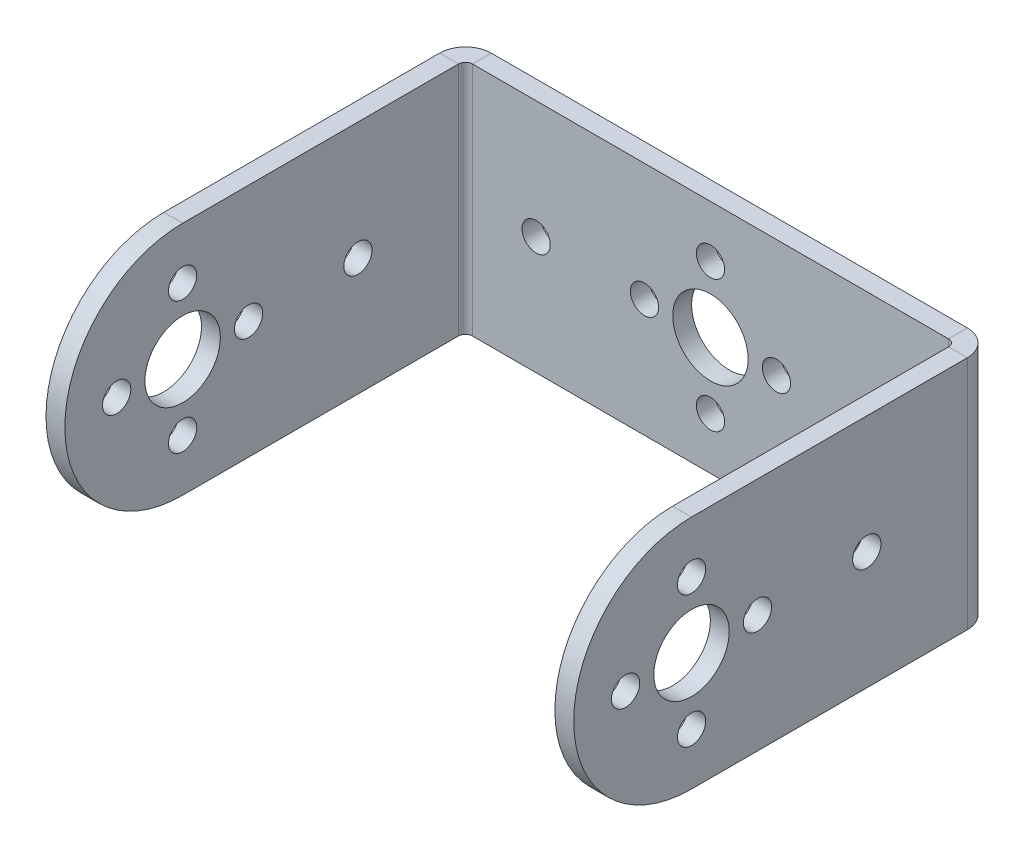
ISO-10303-21;
HEADER;
FILE_DESCRIPTION(('STEP AP214'),'2;1');
FILE_NAME('part.step','',(''),(''),'','','');
FILE_SCHEMA(('AUTOMOTIVE_DESIGN { 1 0 10303 214 1 1 1 1 }'));
ENDSEC;
DATA;
#1=APPLICATION_CONTEXT('core data for automotive mechanical design processes');
#2=APPLICATION_PROTOCOL_DEFINITION('international standard','automotive_design',2000,#1);
#3=PRODUCT_CONTEXT('',#1,'mechanical');
#4=PRODUCT('Part','Part','',(#3));
#5=PRODUCT_RELATED_PRODUCT_CATEGORY('part','',(#4));
#6=PRODUCT_DEFINITION_FORMATION('','',#4);
#7=PRODUCT_DEFINITION_CONTEXT('part definition',#1,'design');
#8=PRODUCT_DEFINITION('design','',#6,#7);
#9=PRODUCT_DEFINITION_SHAPE('','',#8);
#10=(LENGTH_UNIT() NAMED_UNIT(*) SI_UNIT(.MILLI.,.METRE.));
#11=(NAMED_UNIT(*) PLANE_ANGLE_UNIT() SI_UNIT($,.RADIAN.));
#12=(NAMED_UNIT(*) SI_UNIT($,.STERADIAN.) SOLID_ANGLE_UNIT());
#13=UNCERTAINTY_MEASURE_WITH_UNIT(LENGTH_MEASURE(1.E-05),#10,'distance_accuracy_value','');
#14=(GEOMETRIC_REPRESENTATION_CONTEXT(3) GLOBAL_UNCERTAINTY_ASSIGNED_CONTEXT((#13)) GLOBAL_UNIT_ASSIGNED_CONTEXT((#10,
#11,#12)) REPRESENTATION_CONTEXT('',''));
#15=CARTESIAN_POINT('',(0.,0.,0.));
#16=DIRECTION('',(0.,0.,1.));
#17=DIRECTION('',(1.,0.,0.));
#18=AXIS2_PLACEMENT_3D('',#15,#16,#17);
#19=CARTESIAN_POINT('',(-0.999999999999997,-25.,0.));
#20=DIRECTION('',(0.,-1.,0.));
#21=DIRECTION('',(1.,0.,0.));
#22=AXIS2_PLACEMENT_3D('',#19,#20,#21);
#23=PLANE('',#22);
#24=DIRECTION('',(0.,0.,1.));
#25=VECTOR('',#24,1.);
#26=CARTESIAN_POINT('',(1.,-25.,0.));
#27=LINE('',#26,#25);
#28=CARTESIAN_POINT('',(0.999999999999898,-25.,30.0096705338575));
#29=VERTEX_POINT('',#28);
#30=CARTESIAN_POINT('',(1.,-25.,0.736599999999999));
#31=VERTEX_POINT('',#30);
#32=EDGE_CURVE('E196',#29,#31,#27,.F.);
#33=ORIENTED_EDGE('',*,*,#32,.F.);
#34=DIRECTION('',(1.,0.,0.));
#35=VECTOR('',#34,1.);
#36=CARTESIAN_POINT('',(0.999999999999898,-25.,30.0096705338573));
#37=LINE('',#36,#35);
#38=CARTESIAN_POINT('',(-1.0000000000001,-25.,30.0096705338573));
#39=VERTEX_POINT('',#38);
#40=EDGE_CURVE('E100',#29,#39,#37,.F.);
#41=ORIENTED_EDGE('',*,*,#40,.T.);
#42=DIRECTION('',(0.,0.,-1.));
#43=VECTOR('',#42,1.);
#44=CARTESIAN_POINT('',(-0.999999999999997,-25.,0.));
#45=LINE('',#44,#43);
#46=CARTESIAN_POINT('',(-1.,-25.,0.736599999999991));
#47=VERTEX_POINT('',#46);
#48=EDGE_CURVE('E189',#39,#47,#45,.T.);
#49=ORIENTED_EDGE('',*,*,#48,.T.);
#50=DIRECTION('',(-1.,0.,0.));
#51=VECTOR('',#50,1.);
#52=CARTESIAN_POINT('',(1.,-25.,0.736599999999998));
#53=LINE('',#52,#51);
#54=EDGE_CURVE('E213',#31,#47,#53,.T.);
#55=ORIENTED_EDGE('',*,*,#54,.F.);
#56=EDGE_LOOP('',(#33,#41,#49,#55));
#57=FACE_BOUND('',#56,.T.);
#58=ADVANCED_FACE('F82',(#57),#23,.T.);
#59=CARTESIAN_POINT('',(-1.,0.,0.));
#60=DIRECTION('',(-1.,0.,0.));
#61=DIRECTION('',(0.,0.,1.));
#62=AXIS2_PLACEMENT_3D('',#59,#60,#61);
#63=PLANE('',#62);
#64=CARTESIAN_POINT('',(-1.00000000000021,-12.5,11.4096705338575));
#65=DIRECTION('',(1.,0.,0.));
#66=DIRECTION('',(0.,0.,-1.));
#67=AXIS2_PLACEMENT_3D('',#64,#65,#66);
#68=CIRCLE('',#67,1.5);
#69=CARTESIAN_POINT('',(-1.00000000000021,-12.5,9.90967053385751));
#70=VERTEX_POINT('',#69);
#71=EDGE_CURVE('E1079',#70,#70,#68,.T.);
#72=ORIENTED_EDGE('',*,*,#71,.T.);
#73=EDGE_LOOP('',(#72));
#74=FACE_BOUND('',#73,.T.);
#75=CARTESIAN_POINT('',(-1.00000000000017,-12.5,23.0096705338575));
#76=DIRECTION('',(1.,0.,0.));
#77=DIRECTION('',(0.,0.,-1.));
#78=AXIS2_PLACEMENT_3D('',#75,#76,#77);
#79=CIRCLE('',#78,1.5);
#80=CARTESIAN_POINT('',(-1.00000000000018,-12.5,21.5096705338575));
#81=VERTEX_POINT('',#80);
#82=EDGE_CURVE('E347',#81,#81,#79,.T.);
#83=ORIENTED_EDGE('',*,*,#82,.T.);
#84=EDGE_LOOP('',(#83));
#85=FACE_BOUND('',#84,.T.);
#86=CARTESIAN_POINT('',(-1.00000000000015,-5.5,30.0096705338575));
#87=DIRECTION('',(1.,0.,0.));
#88=DIRECTION('',(0.,0.,-1.));
#89=AXIS2_PLACEMENT_3D('',#86,#87,#88);
#90=CIRCLE('',#89,1.5);
#91=CARTESIAN_POINT('',(-1.00000000000015,-5.5,28.5096705338575));
#92=VERTEX_POINT('',#91);
#93=EDGE_CURVE('E342',#92,#92,#90,.T.);
#94=ORIENTED_EDGE('',*,*,#93,.T.);
#95=EDGE_LOOP('',(#94));
#96=FACE_BOUND('',#95,.T.);
#97=CARTESIAN_POINT('',(-1.00000000000013,-12.5,37.0096705338575));
#98=DIRECTION('',(1.,0.,0.));
#99=DIRECTION('',(0.,0.,-1.));
#100=AXIS2_PLACEMENT_3D('',#97,#98,#99);
#101=CIRCLE('',#100,1.5);
#102=CARTESIAN_POINT('',(-1.00000000000013,-12.5,35.5096705338575));
#103=VERTEX_POINT('',#102);
#104=EDGE_CURVE('E337',#103,#103,#101,.T.);
#105=ORIENTED_EDGE('',*,*,#104,.T.);
#106=EDGE_LOOP('',(#105));
#107=FACE_BOUND('',#106,.T.);
#108=CARTESIAN_POINT('',(-1.00000000000015,-19.5,30.0096705338575));
#109=DIRECTION('',(1.,0.,0.));
#110=DIRECTION('',(0.,0.,-1.));
#111=AXIS2_PLACEMENT_3D('',#108,#109,#110);
#112=CIRCLE('',#111,1.5);
#113=CARTESIAN_POINT('',(-1.00000000000015,-19.5,28.5096705338575));
#114=VERTEX_POINT('',#113);
#115=EDGE_CURVE('E331',#114,#114,#112,.T.);
#116=ORIENTED_EDGE('',*,*,#115,.T.);
#117=EDGE_LOOP('',(#116));
#118=FACE_BOUND('',#117,.T.);
#119=CARTESIAN_POINT('',(-1.00000000000015,-12.5,30.0096705338575));
#120=DIRECTION('',(1.,0.,0.));
#121=DIRECTION('',(0.,0.,-1.));
#122=AXIS2_PLACEMENT_3D('',#119,#120,#121);
#123=CIRCLE('',#122,4.);
#124=CARTESIAN_POINT('',(-1.00000000000016,-12.5,26.0096705338575));
#125=VERTEX_POINT('',#124);
#126=EDGE_CURVE('E325',#125,#125,#123,.T.);
#127=ORIENTED_EDGE('',*,*,#126,.T.);
#128=EDGE_LOOP('',(#127));
#129=FACE_BOUND('',#128,.T.);
#130=ORIENTED_EDGE('',*,*,#48,.F.);
#131=CARTESIAN_POINT('',(-1.0000000000001,-12.5,30.0096705338575));
#132=DIRECTION('',(-1.,0.,0.));
#133=DIRECTION('',(0.,0.,1.));
#134=AXIS2_PLACEMENT_3D('',#131,#132,#133);
#135=CIRCLE('',#134,12.5);
#136=CARTESIAN_POINT('',(-1.0000000000001,0.,30.0096705338575));
#137=VERTEX_POINT('',#136);
#138=EDGE_CURVE('E174',#39,#137,#135,.T.);
#139=ORIENTED_EDGE('',*,*,#138,.T.);
#140=DIRECTION('',(0.,0.,1.));
#141=VECTOR('',#140,1.);
#142=CARTESIAN_POINT('',(-1.00000000000016,0.,44.5));
#143=LINE('',#142,#141);
#144=CARTESIAN_POINT('',(-1.,0.,0.73659999999999));
#145=VERTEX_POINT('',#144);
#146=EDGE_CURVE('E188',#145,#137,#143,.T.);
#147=ORIENTED_EDGE('',*,*,#146,.F.);
#148=DIRECTION('',(0.,-1.,0.));
#149=VECTOR('',#148,1.);
#150=CARTESIAN_POINT('',(-1.,0.,0.73659999999999));
#151=LINE('',#150,#149);
#152=EDGE_CURVE('E210',#145,#47,#151,.T.);
#153=ORIENTED_EDGE('',*,*,#152,.T.);
#154=EDGE_LOOP('',(#130,#139,#147,#153));
#155=FACE_BOUND('',#154,.T.);
#156=ADVANCED_FACE('F186',(#74,#85,#96,#107,#118,#129,#155),#63,.T.);
#157=CARTESIAN_POINT('',(1.,0.,0.));
#158=DIRECTION('',(-1.,0.,0.));
#159=DIRECTION('',(0.,0.,1.));
#160=AXIS2_PLACEMENT_3D('',#157,#158,#159);
#161=PLANE('',#160);
#162=CARTESIAN_POINT('',(0.999999999999962,-12.5,11.4096705338575));
#163=DIRECTION('',(-1.,0.,0.));
#164=DIRECTION('',(0.,0.,1.));
#165=AXIS2_PLACEMENT_3D('',#162,#163,#164);
#166=CIRCLE('',#165,1.5);
#167=CARTESIAN_POINT('',(0.999999999999957,-12.5,12.9096705338575));
#168=VERTEX_POINT('',#167);
#169=EDGE_CURVE('E364',#168,#168,#166,.T.);
#170=ORIENTED_EDGE('',*,*,#169,.T.);
#171=EDGE_LOOP('',(#170));
#172=FACE_BOUND('',#171,.T.);
#173=CARTESIAN_POINT('',(0.999999999999922,-12.5,23.0096705338575));
#174=DIRECTION('',(-1.,0.,0.));
#175=DIRECTION('',(0.,0.,1.));
#176=AXIS2_PLACEMENT_3D('',#173,#174,#175);
#177=CIRCLE('',#176,1.5);
#178=CARTESIAN_POINT('',(0.999999999999916,-12.5,24.5096705338575));
#179=VERTEX_POINT('',#178);
#180=EDGE_CURVE('E346',#179,#179,#177,.T.);
#181=ORIENTED_EDGE('',*,*,#180,.T.);
#182=EDGE_LOOP('',(#181));
#183=FACE_BOUND('',#182,.T.);
#184=CARTESIAN_POINT('',(0.999999999999896,-5.5,30.0096705338575));
#185=DIRECTION('',(-1.,0.,0.));
#186=DIRECTION('',(0.,0.,1.));
#187=AXIS2_PLACEMENT_3D('',#184,#185,#186);
#188=CIRCLE('',#187,1.5);
#189=CARTESIAN_POINT('',(0.999999999999891,-5.5,31.5096705338575));
#190=VERTEX_POINT('',#189);
#191=EDGE_CURVE('E341',#190,#190,#188,.T.);
#192=ORIENTED_EDGE('',*,*,#191,.T.);
#193=EDGE_LOOP('',(#192));
#194=FACE_BOUND('',#193,.T.);
#195=CARTESIAN_POINT('',(0.999999999999873,-12.5,37.0096705338575));
#196=DIRECTION('',(-1.,0.,0.));
#197=DIRECTION('',(0.,0.,1.));
#198=AXIS2_PLACEMENT_3D('',#195,#196,#197);
#199=CIRCLE('',#198,1.5);
#200=CARTESIAN_POINT('',(0.999999999999867,-12.5,38.5096705338575));
#201=VERTEX_POINT('',#200);
#202=EDGE_CURVE('E336',#201,#201,#199,.T.);
#203=ORIENTED_EDGE('',*,*,#202,.T.);
#204=EDGE_LOOP('',(#203));
#205=FACE_BOUND('',#204,.T.);
#206=CARTESIAN_POINT('',(0.999999999999898,-19.5,30.0096705338575));
#207=DIRECTION('',(-1.,0.,0.));
#208=DIRECTION('',(0.,0.,1.));
#209=AXIS2_PLACEMENT_3D('',#206,#207,#208);
#210=CIRCLE('',#209,1.5);
#211=CARTESIAN_POINT('',(0.999999999999892,-19.5,31.5096705338575));
#212=VERTEX_POINT('',#211);
#213=EDGE_CURVE('E330',#212,#212,#210,.T.);
#214=ORIENTED_EDGE('',*,*,#213,.T.);
#215=EDGE_LOOP('',(#214));
#216=FACE_BOUND('',#215,.T.);
#217=CARTESIAN_POINT('',(0.999999999999897,-12.5,30.0096705338575));
#218=DIRECTION('',(-1.,0.,0.));
#219=DIRECTION('',(0.,0.,1.));
#220=AXIS2_PLACEMENT_3D('',#217,#218,#219);
#221=CIRCLE('',#220,4.);
#222=CARTESIAN_POINT('',(0.999999999999883,-12.5,34.0096705338575));
#223=VERTEX_POINT('',#222);
#224=EDGE_CURVE('E324',#223,#223,#221,.T.);
#225=ORIENTED_EDGE('',*,*,#224,.T.);
#226=EDGE_LOOP('',(#225));
#227=FACE_BOUND('',#226,.T.);
#228=CARTESIAN_POINT('',(0.999999999999897,-12.5,30.0096705338575));
#229=DIRECTION('',(-1.,0.,0.));
#230=DIRECTION('',(0.,0.,1.));
#231=AXIS2_PLACEMENT_3D('',#228,#229,#230);
#232=CIRCLE('',#231,12.5);
#233=CARTESIAN_POINT('',(0.999999999999895,0.,30.0096705338575));
#234=VERTEX_POINT('',#233);
#235=EDGE_CURVE('E175',#29,#234,#232,.T.);
#236=ORIENTED_EDGE('',*,*,#235,.F.);
#237=ORIENTED_EDGE('',*,*,#32,.T.);
#238=DIRECTION('',(0.,1.,0.));
#239=VECTOR('',#238,1.);
#240=CARTESIAN_POINT('',(0.999999999999997,0.,0.736599999999997));
#241=LINE('',#240,#239);
#242=CARTESIAN_POINT('',(0.999999999999997,0.,0.736599999999997));
#243=VERTEX_POINT('',#242);
#244=EDGE_CURVE('E217',#243,#31,#241,.F.);
#245=ORIENTED_EDGE('',*,*,#244,.F.);
#246=DIRECTION('',(0.,0.,-1.));
#247=VECTOR('',#246,1.);
#248=CARTESIAN_POINT('',(1.,0.,0.));
#249=LINE('',#248,#247);
#250=EDGE_CURVE('E204',#243,#234,#249,.F.);
#251=ORIENTED_EDGE('',*,*,#250,.T.);
#252=EDGE_LOOP('',(#236,#237,#245,#251));
#253=FACE_BOUND('',#252,.T.);
#254=ADVANCED_FACE('F529',(#172,#183,#194,#205,#216,#227,#253),#161,.F.);
#255=CARTESIAN_POINT('',(55.,-25.,0.));
#256=DIRECTION('',(0.,-1.,0.));
#257=DIRECTION('',(0.,0.,-1.));
#258=AXIS2_PLACEMENT_3D('',#255,#256,#257);
#259=PLANE('',#258);
#260=DIRECTION('',(0.,0.,-1.));
#261=VECTOR('',#260,1.);
#262=CARTESIAN_POINT('',(55.,-25.,0.));
#263=LINE('',#262,#261);
#264=CARTESIAN_POINT('',(55.,-25.,0.73659999999999));
#265=VERTEX_POINT('',#264);
#266=CARTESIAN_POINT('',(55.0000000000001,-25.,30.0096705338573));
#267=VERTEX_POINT('',#266);
#268=EDGE_CURVE('E427',#265,#267,#263,.F.);
#269=ORIENTED_EDGE('',*,*,#268,.T.);
#270=DIRECTION('',(-1.,0.,0.));
#271=VECTOR('',#270,1.);
#272=CARTESIAN_POINT('',(53.0000000000001,-25.,30.0096705338573));
#273=LINE('',#272,#271);
#274=CARTESIAN_POINT('',(53.0000000000001,-25.,30.0096705338573));
#275=VERTEX_POINT('',#274);
#276=EDGE_CURVE('E415',#275,#267,#273,.F.);
#277=ORIENTED_EDGE('',*,*,#276,.F.);
#278=DIRECTION('',(0.,0.,1.));
#279=VECTOR('',#278,1.);
#280=CARTESIAN_POINT('',(53.,-25.,-1.8524507770431E-13));
#281=LINE('',#280,#279);
#282=CARTESIAN_POINT('',(53.,-25.,0.736599999999997));
#283=VERTEX_POINT('',#282);
#284=EDGE_CURVE('E434',#283,#275,#281,.T.);
#285=ORIENTED_EDGE('',*,*,#284,.F.);
#286=DIRECTION('',(1.,0.,0.));
#287=VECTOR('',#286,1.);
#288=CARTESIAN_POINT('',(55.,-25.,0.73659999999999));
#289=LINE('',#288,#287);
#290=EDGE_CURVE('E420',#283,#265,#289,.T.);
#291=ORIENTED_EDGE('',*,*,#290,.T.);
#292=EDGE_LOOP('',(#269,#277,#285,#291));
#293=FACE_BOUND('',#292,.T.);
#294=ADVANCED_FACE('F506',(#293),#259,.T.);
#295=CARTESIAN_POINT('',(55.,0.,-1.92228040381996E-13));
#296=DIRECTION('',(-1.,0.,0.));
#297=DIRECTION('',(0.,0.,1.));
#298=AXIS2_PLACEMENT_3D('',#295,#296,#297);
#299=PLANE('',#298);
#300=CARTESIAN_POINT('',(55.,-12.5,11.4096705338573));
#301=DIRECTION('',(1.,0.,0.));
#302=DIRECTION('',(0.,0.,-1.));
#303=AXIS2_PLACEMENT_3D('',#300,#301,#302);
#304=CIRCLE('',#303,1.5);
#305=CARTESIAN_POINT('',(55.,-12.5,9.90967053385731));
#306=VERTEX_POINT('',#305);
#307=EDGE_CURVE('E1082',#306,#306,#304,.T.);
#308=ORIENTED_EDGE('',*,*,#307,.F.);
#309=EDGE_LOOP('',(#308));
#310=FACE_BOUND('',#309,.T.);
#311=CARTESIAN_POINT('',(55.0000000000001,-12.5,23.0096705338573));
#312=DIRECTION('',(1.,0.,0.));
#313=DIRECTION('',(0.,0.,-1.));
#314=AXIS2_PLACEMENT_3D('',#311,#312,#313);
#315=CIRCLE('',#314,1.5);
#316=CARTESIAN_POINT('',(55.0000000000001,-12.5,21.5096705338573));
#317=VERTEX_POINT('',#316);
#318=EDGE_CURVE('E357',#317,#317,#315,.T.);
#319=ORIENTED_EDGE('',*,*,#318,.F.);
#320=EDGE_LOOP('',(#319));
#321=FACE_BOUND('',#320,.T.);
#322=CARTESIAN_POINT('',(55.0000000000001,-5.5,30.0096705338573));
#323=DIRECTION('',(1.,0.,0.));
#324=DIRECTION('',(0.,0.,-1.));
#325=AXIS2_PLACEMENT_3D('',#322,#323,#324);
#326=CIRCLE('',#325,1.5);
#327=CARTESIAN_POINT('',(55.0000000000001,-5.5,28.5096705338573));
#328=VERTEX_POINT('',#327);
#329=EDGE_CURVE('E353',#328,#328,#326,.T.);
#330=ORIENTED_EDGE('',*,*,#329,.F.);
#331=EDGE_LOOP('',(#330));
#332=FACE_BOUND('',#331,.T.);
#333=CARTESIAN_POINT('',(55.0000000000001,-12.5,37.0096705338573));
#334=DIRECTION('',(1.,0.,0.));
#335=DIRECTION('',(0.,0.,-1.));
#336=AXIS2_PLACEMENT_3D('',#333,#334,#335);
#337=CIRCLE('',#336,1.5);
#338=CARTESIAN_POINT('',(55.0000000000001,-12.5,35.5096705338573));
#339=VERTEX_POINT('',#338);
#340=EDGE_CURVE('E378',#339,#339,#337,.T.);
#341=ORIENTED_EDGE('',*,*,#340,.F.);
#342=EDGE_LOOP('',(#341));
#343=FACE_BOUND('',#342,.T.);
#344=CARTESIAN_POINT('',(55.0000000000001,-19.5,30.0096705338573));
#345=DIRECTION('',(1.,0.,0.));
#346=DIRECTION('',(0.,0.,-1.));
#347=AXIS2_PLACEMENT_3D('',#344,#345,#346);
#348=CIRCLE('',#347,1.5);
#349=CARTESIAN_POINT('',(55.0000000000001,-19.5,28.5096705338573));
#350=VERTEX_POINT('',#349);
#351=EDGE_CURVE('E388',#350,#350,#348,.T.);
#352=ORIENTED_EDGE('',*,*,#351,.F.);
#353=EDGE_LOOP('',(#352));
#354=FACE_BOUND('',#353,.T.);
#355=CARTESIAN_POINT('',(55.0000000000001,-12.5,30.0096705338573));
#356=DIRECTION('',(1.,0.,0.));
#357=DIRECTION('',(0.,0.,-1.));
#358=AXIS2_PLACEMENT_3D('',#355,#356,#357);
#359=CIRCLE('',#358,4.);
#360=CARTESIAN_POINT('',(55.0000000000001,-12.5,26.0096705338573));
#361=VERTEX_POINT('',#360);
#362=EDGE_CURVE('E398',#361,#361,#359,.T.);
#363=ORIENTED_EDGE('',*,*,#362,.F.);
#364=EDGE_LOOP('',(#363));
#365=FACE_BOUND('',#364,.T.);
#366=CARTESIAN_POINT('',(55.0000000000001,-12.5,30.0096705338573));
#367=DIRECTION('',(-1.,0.,0.));
#368=DIRECTION('',(0.,0.,1.));
#369=AXIS2_PLACEMENT_3D('',#366,#367,#368);
#370=CIRCLE('',#369,12.5);
#371=CARTESIAN_POINT('',(55.0000000000001,0.,30.0096705338573));
#372=VERTEX_POINT('',#371);
#373=EDGE_CURVE('E412',#267,#372,#370,.T.);
#374=ORIENTED_EDGE('',*,*,#373,.F.);
#375=ORIENTED_EDGE('',*,*,#268,.F.);
#376=DIRECTION('',(0.,1.,0.));
#377=VECTOR('',#376,1.);
#378=CARTESIAN_POINT('',(55.,-25.,0.73659999999999));
#379=LINE('',#378,#377);
#380=CARTESIAN_POINT('',(55.,0.,0.73659999999999));
#381=VERTEX_POINT('',#380);
#382=EDGE_CURVE('E438',#381,#265,#379,.F.);
#383=ORIENTED_EDGE('',*,*,#382,.F.);
#384=DIRECTION('',(0.,0.,1.));
#385=VECTOR('',#384,1.);
#386=CARTESIAN_POINT('',(55.0000000000002,0.,44.5));
#387=LINE('',#386,#385);
#388=EDGE_CURVE('E423',#372,#381,#387,.F.);
#389=ORIENTED_EDGE('',*,*,#388,.F.);
#390=EDGE_LOOP('',(#374,#375,#383,#389));
#391=FACE_BOUND('',#390,.T.);
#392=ADVANCED_FACE('F500',(#310,#321,#332,#343,#354,#365,#391),#299,.F.);
#393=CARTESIAN_POINT('',(53.,0.,-1.8524507770431E-13));
#394=DIRECTION('',(-1.,0.,0.));
#395=DIRECTION('',(0.,0.,1.));
#396=AXIS2_PLACEMENT_3D('',#393,#394,#395);
#397=PLANE('',#396);
#398=CARTESIAN_POINT('',(53.,-12.5,11.4096705338573));
#399=DIRECTION('',(-1.,0.,0.));
#400=DIRECTION('',(0.,0.,1.));
#401=AXIS2_PLACEMENT_3D('',#398,#399,#400);
#402=CIRCLE('',#401,1.5);
#403=CARTESIAN_POINT('',(53.,-12.5,12.9096705338573));
#404=VERTEX_POINT('',#403);
#405=EDGE_CURVE('E86',#404,#404,#402,.T.);
#406=ORIENTED_EDGE('',*,*,#405,.F.);
#407=EDGE_LOOP('',(#406));
#408=FACE_BOUND('',#407,.T.);
#409=CARTESIAN_POINT('',(53.0000000000001,-12.5,23.0096705338573));
#410=DIRECTION('',(-1.,0.,0.));
#411=DIRECTION('',(0.,0.,1.));
#412=AXIS2_PLACEMENT_3D('',#409,#410,#411);
#413=CIRCLE('',#412,1.5);
#414=CARTESIAN_POINT('',(53.0000000000001,-12.5,24.5096705338573));
#415=VERTEX_POINT('',#414);
#416=EDGE_CURVE('E343',#415,#415,#413,.T.);
#417=ORIENTED_EDGE('',*,*,#416,.F.);
#418=EDGE_LOOP('',(#417));
#419=FACE_BOUND('',#418,.T.);
#420=CARTESIAN_POINT('',(53.0000000000001,-5.5,30.0096705338573));
#421=DIRECTION('',(-1.,0.,0.));
#422=DIRECTION('',(0.,0.,1.));
#423=AXIS2_PLACEMENT_3D('',#420,#421,#422);
#424=CIRCLE('',#423,1.5);
#425=CARTESIAN_POINT('',(53.0000000000001,-5.5,31.5096705338573));
#426=VERTEX_POINT('',#425);
#427=EDGE_CURVE('E338',#426,#426,#424,.T.);
#428=ORIENTED_EDGE('',*,*,#427,.F.);
#429=EDGE_LOOP('',(#428));
#430=FACE_BOUND('',#429,.T.);
#431=CARTESIAN_POINT('',(53.0000000000001,-12.5,37.0096705338573));
#432=DIRECTION('',(-1.,0.,0.));
#433=DIRECTION('',(0.,0.,1.));
#434=AXIS2_PLACEMENT_3D('',#431,#432,#433);
#435=CIRCLE('',#434,1.5);
#436=CARTESIAN_POINT('',(53.0000000000001,-12.5,38.5096705338573));
#437=VERTEX_POINT('',#436);
#438=EDGE_CURVE('E332',#437,#437,#435,.T.);
#439=ORIENTED_EDGE('',*,*,#438,.F.);
#440=EDGE_LOOP('',(#439));
#441=FACE_BOUND('',#440,.T.);
#442=CARTESIAN_POINT('',(53.0000000000001,-19.5,30.0096705338573));
#443=DIRECTION('',(-1.,0.,0.));
#444=DIRECTION('',(0.,0.,1.));
#445=AXIS2_PLACEMENT_3D('',#442,#443,#444);
#446=CIRCLE('',#445,1.5);
#447=CARTESIAN_POINT('',(53.0000000000001,-19.5,31.5096705338573));
#448=VERTEX_POINT('',#447);
#449=EDGE_CURVE('E326',#448,#448,#446,.T.);
#450=ORIENTED_EDGE('',*,*,#449,.F.);
#451=EDGE_LOOP('',(#450));
#452=FACE_BOUND('',#451,.T.);
#453=CARTESIAN_POINT('',(53.0000000000001,-12.5,30.0096705338573));
#454=DIRECTION('',(-1.,0.,0.));
#455=DIRECTION('',(0.,0.,1.));
#456=AXIS2_PLACEMENT_3D('',#453,#454,#455);
#457=CIRCLE('',#456,4.);
#458=CARTESIAN_POINT('',(53.0000000000001,-12.5,34.0096705338573));
#459=VERTEX_POINT('',#458);
#460=EDGE_CURVE('E320',#459,#459,#457,.T.);
#461=ORIENTED_EDGE('',*,*,#460,.F.);
#462=EDGE_LOOP('',(#461));
#463=FACE_BOUND('',#462,.T.);
#464=ORIENTED_EDGE('',*,*,#284,.T.);
#465=CARTESIAN_POINT('',(53.0000000000001,-12.5,30.0096705338573));
#466=DIRECTION('',(-1.,0.,0.));
#467=DIRECTION('',(0.,0.,1.));
#468=AXIS2_PLACEMENT_3D('',#465,#466,#467);
#469=CIRCLE('',#468,12.5);
#470=CARTESIAN_POINT('',(53.0000000000001,0.,30.0096705338573));
#471=VERTEX_POINT('',#470);
#472=EDGE_CURVE('E181',#275,#471,#469,.T.);
#473=ORIENTED_EDGE('',*,*,#472,.T.);
#474=DIRECTION('',(0.,0.,-1.));
#475=VECTOR('',#474,1.);
#476=CARTESIAN_POINT('',(53.,0.,-1.8524507770431E-13));
#477=LINE('',#476,#475);
#478=CARTESIAN_POINT('',(53.,0.,0.736599999999997));
#479=VERTEX_POINT('',#478);
#480=EDGE_CURVE('E431',#471,#479,#477,.T.);
#481=ORIENTED_EDGE('',*,*,#480,.T.);
#482=DIRECTION('',(0.,1.,0.));
#483=VECTOR('',#482,1.);
#484=CARTESIAN_POINT('',(53.,-25.,0.736599999999997));
#485=LINE('',#484,#483);
#486=EDGE_CURVE('E445',#283,#479,#485,.T.);
#487=ORIENTED_EDGE('',*,*,#486,.F.);
#488=EDGE_LOOP('',(#464,#473,#481,#487));
#489=FACE_BOUND('',#488,.T.);
#490=ADVANCED_FACE('F510',(#408,#419,#430,#441,#452,#463,#489),#397,.T.);
#491=CARTESIAN_POINT('',(0.,0.,-2.));
#492=DIRECTION('',(0.,0.,1.));
#493=DIRECTION('',(1.,0.,0.));
#494=AXIS2_PLACEMENT_3D('',#491,#492,#493);
#495=PLANE('',#494);
#496=CARTESIAN_POINT('',(8.5,-12.5,-2.));
#497=DIRECTION('',(0.,0.,1.));
#498=DIRECTION('',(1.,0.,0.));
#499=AXIS2_PLACEMENT_3D('',#496,#497,#498);
#500=CIRCLE('',#499,1.5);
#501=CARTESIAN_POINT('',(10.,-12.5,-2.));
#502=VERTEX_POINT('',#501);
#503=EDGE_CURVE('E256',#502,#502,#500,.T.);
#504=ORIENTED_EDGE('',*,*,#503,.T.);
#505=EDGE_LOOP('',(#504));
#506=FACE_BOUND('',#505,.T.);
#507=CARTESIAN_POINT('',(45.5,-12.5,-2.));
#508=DIRECTION('',(0.,0.,1.));
#509=DIRECTION('',(1.,0.,0.));
#510=AXIS2_PLACEMENT_3D('',#507,#508,#509);
#511=CIRCLE('',#510,1.5);
#512=CARTESIAN_POINT('',(47.,-12.5,-2.));
#513=VERTEX_POINT('',#512);
#514=EDGE_CURVE('E264',#513,#513,#511,.T.);
#515=ORIENTED_EDGE('',*,*,#514,.T.);
#516=EDGE_LOOP('',(#515));
#517=FACE_BOUND('',#516,.T.);
#518=CARTESIAN_POINT('',(20.,-12.5,-2.));
#519=DIRECTION('',(0.,0.,1.));
#520=DIRECTION('',(1.,0.,0.));
#521=AXIS2_PLACEMENT_3D('',#518,#519,#520);
#522=CIRCLE('',#521,1.5);
#523=CARTESIAN_POINT('',(21.5,-12.5,-2.));
#524=VERTEX_POINT('',#523);
#525=EDGE_CURVE('E272',#524,#524,#522,.T.);
#526=ORIENTED_EDGE('',*,*,#525,.T.);
#527=EDGE_LOOP('',(#526));
#528=FACE_BOUND('',#527,.T.);
#529=CARTESIAN_POINT('',(34.,-12.5,-2.));
#530=DIRECTION('',(0.,0.,1.));
#531=DIRECTION('',(1.,0.,0.));
#532=AXIS2_PLACEMENT_3D('',#529,#530,#531);
#533=CIRCLE('',#532,1.5);
#534=CARTESIAN_POINT('',(35.5,-12.5,-2.));
#535=VERTEX_POINT('',#534);
#536=EDGE_CURVE('E280',#535,#535,#533,.T.);
#537=ORIENTED_EDGE('',*,*,#536,.T.);
#538=EDGE_LOOP('',(#537));
#539=FACE_BOUND('',#538,.T.);
#540=CARTESIAN_POINT('',(27.,-19.5,-2.));
#541=DIRECTION('',(0.,0.,1.));
#542=DIRECTION('',(1.,0.,0.));
#543=AXIS2_PLACEMENT_3D('',#540,#541,#542);
#544=CIRCLE('',#543,1.5);
#545=CARTESIAN_POINT('',(28.5,-19.5,-2.));
#546=VERTEX_POINT('',#545);
#547=EDGE_CURVE('E288',#546,#546,#544,.T.);
#548=ORIENTED_EDGE('',*,*,#547,.T.);
#549=EDGE_LOOP('',(#548));
#550=FACE_BOUND('',#549,.T.);
#551=CARTESIAN_POINT('',(27.,-5.5,-2.));
#552=DIRECTION('',(0.,0.,1.));
#553=DIRECTION('',(1.,0.,0.));
#554=AXIS2_PLACEMENT_3D('',#551,#552,#553);
#555=CIRCLE('',#554,1.5);
#556=CARTESIAN_POINT('',(28.5,-5.5,-2.));
#557=VERTEX_POINT('',#556);
#558=EDGE_CURVE('E295',#557,#557,#555,.T.);
#559=ORIENTED_EDGE('',*,*,#558,.T.);
#560=EDGE_LOOP('',(#559));
#561=FACE_BOUND('',#560,.T.);
#562=CARTESIAN_POINT('',(27.,-12.5,-2.));
#563=DIRECTION('',(0.,0.,1.));
#564=DIRECTION('',(1.,0.,0.));
#565=AXIS2_PLACEMENT_3D('',#562,#563,#564);
#566=CIRCLE('',#565,4.);
#567=CARTESIAN_POINT('',(31.,-12.5,-2.));
#568=VERTEX_POINT('',#567);
#569=EDGE_CURVE('E303',#568,#568,#566,.T.);
#570=ORIENTED_EDGE('',*,*,#569,.T.);
#571=EDGE_LOOP('',(#570));
#572=FACE_BOUND('',#571,.T.);
#573=DIRECTION('',(0.,1.,0.));
#574=VECTOR('',#573,1.);
#575=CARTESIAN_POINT('',(52.2634,0.,-2.));
#576=LINE('',#575,#574);
#577=CARTESIAN_POINT('',(52.2634,0.,-2.));
#578=VERTEX_POINT('',#577);
#579=CARTESIAN_POINT('',(52.2634,-25.,-2.));
#580=VERTEX_POINT('',#579);
#581=EDGE_CURVE('E452',#578,#580,#576,.F.);
#582=ORIENTED_EDGE('',*,*,#581,.T.);
#583=DIRECTION('',(1.,0.,0.));
#584=VECTOR('',#583,1.);
#585=CARTESIAN_POINT('',(0.,-25.,-2.));
#586=LINE('',#585,#584);
#587=CARTESIAN_POINT('',(1.73659999999999,-25.,-2.));
#588=VERTEX_POINT('',#587);
#589=EDGE_CURVE('E92',#588,#580,#586,.T.);
#590=ORIENTED_EDGE('',*,*,#589,.F.);
#591=DIRECTION('',(0.,-1.,0.));
#592=VECTOR('',#591,1.);
#593=CARTESIAN_POINT('',(1.73659999999999,-25.,-2.));
#594=LINE('',#593,#592);
#595=CARTESIAN_POINT('',(1.73659999999999,0.,-2.));
#596=VERTEX_POINT('',#595);
#597=EDGE_CURVE('E224',#588,#596,#594,.F.);
#598=ORIENTED_EDGE('',*,*,#597,.T.);
#599=DIRECTION('',(-1.,0.,0.));
#600=VECTOR('',#599,1.);
#601=CARTESIAN_POINT('',(0.,0.,-2.));
#602=LINE('',#601,#600);
#603=EDGE_CURVE('E13',#578,#596,#602,.T.);
#604=ORIENTED_EDGE('',*,*,#603,.F.);
#605=EDGE_LOOP('',(#582,#590,#598,#604));
#606=FACE_BOUND('',#605,.T.);
#607=ADVANCED_FACE('F751',(#506,#517,#528,#539,#550,#561,#572,#606),#495,.F.);
#608=CARTESIAN_POINT('',(0.,0.,0.));
#609=DIRECTION('',(0.,0.,1.));
#610=DIRECTION('',(1.,0.,0.));
#611=AXIS2_PLACEMENT_3D('',#608,#609,#610);
#612=PLANE('',#611);
#613=CARTESIAN_POINT('',(8.5,-12.5,0.));
#614=DIRECTION('',(0.,0.,1.));
#615=DIRECTION('',(1.,0.,0.));
#616=AXIS2_PLACEMENT_3D('',#613,#614,#615);
#617=CIRCLE('',#616,1.5);
#618=CARTESIAN_POINT('',(10.,-12.5,0.));
#619=VERTEX_POINT('',#618);
#620=EDGE_CURVE('E252',#619,#619,#617,.T.);
#621=ORIENTED_EDGE('',*,*,#620,.F.);
#622=EDGE_LOOP('',(#621));
#623=FACE_BOUND('',#622,.T.);
#624=CARTESIAN_POINT('',(45.5,-12.5,0.));
#625=DIRECTION('',(0.,0.,1.));
#626=DIRECTION('',(1.,0.,0.));
#627=AXIS2_PLACEMENT_3D('',#624,#625,#626);
#628=CIRCLE('',#627,1.5);
#629=CARTESIAN_POINT('',(47.,-12.5,0.));
#630=VERTEX_POINT('',#629);
#631=EDGE_CURVE('E260',#630,#630,#628,.T.);
#632=ORIENTED_EDGE('',*,*,#631,.F.);
#633=EDGE_LOOP('',(#632));
#634=FACE_BOUND('',#633,.T.);
#635=CARTESIAN_POINT('',(20.,-12.5,0.));
#636=DIRECTION('',(0.,0.,1.));
#637=DIRECTION('',(1.,0.,0.));
#638=AXIS2_PLACEMENT_3D('',#635,#636,#637);
#639=CIRCLE('',#638,1.5);
#640=CARTESIAN_POINT('',(21.5,-12.5,0.));
#641=VERTEX_POINT('',#640);
#642=EDGE_CURVE('E268',#641,#641,#639,.T.);
#643=ORIENTED_EDGE('',*,*,#642,.F.);
#644=EDGE_LOOP('',(#643));
#645=FACE_BOUND('',#644,.T.);
#646=CARTESIAN_POINT('',(34.,-12.5,0.));
#647=DIRECTION('',(0.,0.,1.));
#648=DIRECTION('',(1.,0.,0.));
#649=AXIS2_PLACEMENT_3D('',#646,#647,#648);
#650=CIRCLE('',#649,1.5);
#651=CARTESIAN_POINT('',(35.5,-12.5,0.));
#652=VERTEX_POINT('',#651);
#653=EDGE_CURVE('E276',#652,#652,#650,.T.);
#654=ORIENTED_EDGE('',*,*,#653,.F.);
#655=EDGE_LOOP('',(#654));
#656=FACE_BOUND('',#655,.T.);
#657=CARTESIAN_POINT('',(27.,-19.5,0.));
#658=DIRECTION('',(0.,0.,1.));
#659=DIRECTION('',(1.,0.,0.));
#660=AXIS2_PLACEMENT_3D('',#657,#658,#659);
#661=CIRCLE('',#660,1.5);
#662=CARTESIAN_POINT('',(28.5,-19.5,0.));
#663=VERTEX_POINT('',#662);
#664=EDGE_CURVE('E284',#663,#663,#661,.T.);
#665=ORIENTED_EDGE('',*,*,#664,.F.);
#666=EDGE_LOOP('',(#665));
#667=FACE_BOUND('',#666,.T.);
#668=CARTESIAN_POINT('',(27.,-5.5,0.));
#669=DIRECTION('',(0.,0.,1.));
#670=DIRECTION('',(1.,0.,0.));
#671=AXIS2_PLACEMENT_3D('',#668,#669,#670);
#672=CIRCLE('',#671,1.5);
#673=CARTESIAN_POINT('',(28.5,-5.5,0.));
#674=VERTEX_POINT('',#673);
#675=EDGE_CURVE('E291',#674,#674,#672,.T.);
#676=ORIENTED_EDGE('',*,*,#675,.F.);
#677=EDGE_LOOP('',(#676));
#678=FACE_BOUND('',#677,.T.);
#679=CARTESIAN_POINT('',(27.,-12.5,0.));
#680=DIRECTION('',(0.,0.,1.));
#681=DIRECTION('',(1.,0.,0.));
#682=AXIS2_PLACEMENT_3D('',#679,#680,#681);
#683=CIRCLE('',#682,4.);
#684=CARTESIAN_POINT('',(31.,-12.5,0.));
#685=VERTEX_POINT('',#684);
#686=EDGE_CURVE('E299',#685,#685,#683,.T.);
#687=ORIENTED_EDGE('',*,*,#686,.F.);
#688=EDGE_LOOP('',(#687));
#689=FACE_BOUND('',#688,.T.);
#690=DIRECTION('',(1.,0.,0.));
#691=VECTOR('',#690,1.);
#692=CARTESIAN_POINT('',(0.,-25.,0.));
#693=LINE('',#692,#691);
#694=CARTESIAN_POINT('',(1.7366,-25.,0.));
#695=VERTEX_POINT('',#694);
#696=CARTESIAN_POINT('',(52.2634,-25.,0.));
#697=VERTEX_POINT('',#696);
#698=EDGE_CURVE('E307',#695,#697,#693,.T.);
#699=ORIENTED_EDGE('',*,*,#698,.T.);
#700=DIRECTION('',(0.,1.,0.));
#701=VECTOR('',#700,1.);
#702=CARTESIAN_POINT('',(52.2634,0.,0.));
#703=LINE('',#702,#701);
#704=CARTESIAN_POINT('',(52.2634,0.,0.));
#705=VERTEX_POINT('',#704);
#706=EDGE_CURVE('E467',#705,#697,#703,.F.);
#707=ORIENTED_EDGE('',*,*,#706,.F.);
#708=DIRECTION('',(-1.,0.,0.));
#709=VECTOR('',#708,1.);
#710=CARTESIAN_POINT('',(0.,0.,0.));
#711=LINE('',#710,#709);
#712=CARTESIAN_POINT('',(1.73659999999999,0.,0.));
#713=VERTEX_POINT('',#712);
#714=EDGE_CURVE('E313',#705,#713,#711,.T.);
#715=ORIENTED_EDGE('',*,*,#714,.T.);
#716=DIRECTION('',(0.,-1.,0.));
#717=VECTOR('',#716,1.);
#718=CARTESIAN_POINT('',(1.7366,-25.,0.));
#719=LINE('',#718,#717);
#720=EDGE_CURVE('E241',#695,#713,#719,.F.);
#721=ORIENTED_EDGE('',*,*,#720,.F.);
#722=EDGE_LOOP('',(#699,#707,#715,#721));
#723=FACE_BOUND('',#722,.T.);
#724=ADVANCED_FACE('F514',(#623,#634,#645,#656,#667,#678,#689,#723),#612,.T.);
#725=CARTESIAN_POINT('',(0.,0.,-2.));
#726=DIRECTION('',(0.,1.,0.));
#727=DIRECTION('',(0.,0.,1.));
#728=AXIS2_PLACEMENT_3D('',#725,#726,#727);
#729=PLANE('',#728);
#730=ORIENTED_EDGE('',*,*,#714,.F.);
#731=DIRECTION('',(0.,0.,-1.));
#732=VECTOR('',#731,1.);
#733=CARTESIAN_POINT('',(52.2634,0.,0.));
#734=LINE('',#733,#732);
#735=EDGE_CURVE('E460',#705,#578,#734,.T.);
#736=ORIENTED_EDGE('',*,*,#735,.T.);
#737=ORIENTED_EDGE('',*,*,#603,.T.);
#738=DIRECTION('',(0.,0.,-1.));
#739=VECTOR('',#738,1.);
#740=CARTESIAN_POINT('',(1.73659999999999,0.,0.));
#741=LINE('',#740,#739);
#742=EDGE_CURVE('E248',#713,#596,#741,.T.);
#743=ORIENTED_EDGE('',*,*,#742,.F.);
#744=EDGE_LOOP('',(#730,#736,#737,#743));
#745=FACE_BOUND('',#744,.T.);
#746=ADVANCED_FACE('F482',(#745),#729,.T.);
#747=CARTESIAN_POINT('',(0.,-25.,-2.));
#748=DIRECTION('',(0.,-1.,0.));
#749=DIRECTION('',(0.,0.,-1.));
#750=AXIS2_PLACEMENT_3D('',#747,#748,#749);
#751=PLANE('',#750);
#752=DIRECTION('',(0.,0.,-1.));
#753=VECTOR('',#752,1.);
#754=CARTESIAN_POINT('',(52.2634,-25.,0.));
#755=LINE('',#754,#753);
#756=EDGE_CURVE('E223',#697,#580,#755,.T.);
#757=ORIENTED_EDGE('',*,*,#756,.F.);
#758=ORIENTED_EDGE('',*,*,#698,.F.);
#759=DIRECTION('',(0.,0.,-1.));
#760=VECTOR('',#759,1.);
#761=CARTESIAN_POINT('',(1.7366,-25.,0.));
#762=LINE('',#761,#760);
#763=EDGE_CURVE('E233',#695,#588,#762,.T.);
#764=ORIENTED_EDGE('',*,*,#763,.T.);
#765=ORIENTED_EDGE('',*,*,#589,.T.);
#766=EDGE_LOOP('',(#757,#758,#764,#765));
#767=FACE_BOUND('',#766,.T.);
#768=ADVANCED_FACE('F84',(#767),#751,.T.);
#769=CARTESIAN_POINT('',(27.,-12.5,-2.));
#770=DIRECTION('',(0.,0.,1.));
#771=DIRECTION('',(1.,0.,0.));
#772=AXIS2_PLACEMENT_3D('',#769,#770,#771);
#773=CYLINDRICAL_SURFACE('',#772,4.);
#774=ORIENTED_EDGE('',*,*,#569,.F.);
#775=EDGE_LOOP('',(#774));
#776=FACE_BOUND('',#775,.T.);
#777=ORIENTED_EDGE('',*,*,#686,.T.);
#778=EDGE_LOOP('',(#777));
#779=FACE_BOUND('',#778,.T.);
#780=ADVANCED_FACE('F863',(#776,#779),#773,.F.);
#781=CARTESIAN_POINT('',(27.,-5.5,-2.));
#782=DIRECTION('',(0.,0.,1.));
#783=DIRECTION('',(1.,0.,0.));
#784=AXIS2_PLACEMENT_3D('',#781,#782,#783);
#785=CYLINDRICAL_SURFACE('',#784,1.5);
#786=ORIENTED_EDGE('',*,*,#558,.F.);
#787=EDGE_LOOP('',(#786));
#788=FACE_BOUND('',#787,.T.);
#789=ORIENTED_EDGE('',*,*,#675,.T.);
#790=EDGE_LOOP('',(#789));
#791=FACE_BOUND('',#790,.T.);
#792=ADVANCED_FACE('F936',(#788,#791),#785,.F.);
#793=CARTESIAN_POINT('',(27.,-19.5,-2.));
#794=DIRECTION('',(0.,0.,1.));
#795=DIRECTION('',(1.,0.,0.));
#796=AXIS2_PLACEMENT_3D('',#793,#794,#795);
#797=CYLINDRICAL_SURFACE('',#796,1.5);
#798=ORIENTED_EDGE('',*,*,#547,.F.);
#799=EDGE_LOOP('',(#798));
#800=FACE_BOUND('',#799,.T.);
#801=ORIENTED_EDGE('',*,*,#664,.T.);
#802=EDGE_LOOP('',(#801));
#803=FACE_BOUND('',#802,.T.);
#804=ADVANCED_FACE('F925',(#800,#803),#797,.F.);
#805=CARTESIAN_POINT('',(34.,-12.5,-2.));
#806=DIRECTION('',(0.,0.,1.));
#807=DIRECTION('',(1.,0.,0.));
#808=AXIS2_PLACEMENT_3D('',#805,#806,#807);
#809=CYLINDRICAL_SURFACE('',#808,1.5);
#810=ORIENTED_EDGE('',*,*,#536,.F.);
#811=EDGE_LOOP('',(#810));
#812=FACE_BOUND('',#811,.T.);
#813=ORIENTED_EDGE('',*,*,#653,.T.);
#814=EDGE_LOOP('',(#813));
#815=FACE_BOUND('',#814,.T.);
#816=ADVANCED_FACE('F914',(#812,#815),#809,.F.);
#817=CARTESIAN_POINT('',(20.,-12.5,-2.));
#818=DIRECTION('',(0.,0.,1.));
#819=DIRECTION('',(1.,0.,0.));
#820=AXIS2_PLACEMENT_3D('',#817,#818,#819);
#821=CYLINDRICAL_SURFACE('',#820,1.5);
#822=ORIENTED_EDGE('',*,*,#525,.F.);
#823=EDGE_LOOP('',(#822));
#824=FACE_BOUND('',#823,.T.);
#825=ORIENTED_EDGE('',*,*,#642,.T.);
#826=EDGE_LOOP('',(#825));
#827=FACE_BOUND('',#826,.T.);
#828=ADVANCED_FACE('F903',(#824,#827),#821,.F.);
#829=CARTESIAN_POINT('',(45.5,-12.5,-2.));
#830=DIRECTION('',(0.,0.,1.));
#831=DIRECTION('',(1.,0.,0.));
#832=AXIS2_PLACEMENT_3D('',#829,#830,#831);
#833=CYLINDRICAL_SURFACE('',#832,1.5);
#834=ORIENTED_EDGE('',*,*,#514,.F.);
#835=EDGE_LOOP('',(#834));
#836=FACE_BOUND('',#835,.T.);
#837=ORIENTED_EDGE('',*,*,#631,.T.);
#838=EDGE_LOOP('',(#837));
#839=FACE_BOUND('',#838,.T.);
#840=ADVANCED_FACE('F545',(#836,#839),#833,.F.);
#841=CARTESIAN_POINT('',(8.5,-12.5,-2.));
#842=DIRECTION('',(0.,0.,1.));
#843=DIRECTION('',(1.,0.,0.));
#844=AXIS2_PLACEMENT_3D('',#841,#842,#843);
#845=CYLINDRICAL_SURFACE('',#844,1.5);
#846=ORIENTED_EDGE('',*,*,#503,.F.);
#847=EDGE_LOOP('',(#846));
#848=FACE_BOUND('',#847,.T.);
#849=ORIENTED_EDGE('',*,*,#620,.T.);
#850=EDGE_LOOP('',(#849));
#851=FACE_BOUND('',#850,.T.);
#852=ADVANCED_FACE('F538',(#848,#851),#845,.F.);
#853=CARTESIAN_POINT('',(1.7366,0.,0.736599999999999));
#854=DIRECTION('',(0.,1.,0.));
#855=DIRECTION('',(-1.,0.,0.));
#856=AXIS2_PLACEMENT_3D('',#853,#854,#855);
#857=PLANE('',#856);
#858=DIRECTION('',(-1.,0.,0.));
#859=VECTOR('',#858,1.);
#860=CARTESIAN_POINT('',(-1.,0.,0.73659999999999));
#861=LINE('',#860,#859);
#862=EDGE_CURVE('E194',#243,#145,#861,.T.);
#863=ORIENTED_EDGE('',*,*,#862,.F.);
#864=CARTESIAN_POINT('',(1.7366,0.,0.736599999999999));
#865=DIRECTION('',(0.,-1.,0.));
#866=DIRECTION('',(1.,0.,0.));
#867=AXIS2_PLACEMENT_3D('',#864,#865,#866);
#868=CIRCLE('',#867,0.736599999999998);
#869=EDGE_CURVE('E237',#713,#243,#868,.F.);
#870=ORIENTED_EDGE('',*,*,#869,.F.);
#871=ORIENTED_EDGE('',*,*,#742,.T.);
#872=CARTESIAN_POINT('',(1.7366,0.,0.736599999999999));
#873=DIRECTION('',(0.,-1.,0.));
#874=DIRECTION('',(1.,0.,0.));
#875=AXIS2_PLACEMENT_3D('',#872,#873,#874);
#876=CIRCLE('',#875,2.7366);
#877=EDGE_CURVE('E228',#596,#145,#876,.F.);
#878=ORIENTED_EDGE('',*,*,#877,.T.);
#879=EDGE_LOOP('',(#863,#870,#871,#878));
#880=FACE_BOUND('',#879,.T.);
#881=ADVANCED_FACE('F536',(#880),#857,.T.);
#882=CARTESIAN_POINT('',(1.7366,-25.,0.736600000000001));
#883=DIRECTION('',(0.,1.,0.));
#884=DIRECTION('',(-1.,0.,0.));
#885=AXIS2_PLACEMENT_3D('',#882,#883,#884);
#886=PLANE('',#885);
#887=CARTESIAN_POINT('',(1.7366,-25.,0.736600000000001));
#888=DIRECTION('',(0.,-1.,0.));
#889=DIRECTION('',(1.,0.,0.));
#890=AXIS2_PLACEMENT_3D('',#887,#888,#889);
#891=CIRCLE('',#890,0.736599999999998);
#892=EDGE_CURVE('E201',#31,#695,#891,.T.);
#893=ORIENTED_EDGE('',*,*,#892,.F.);
#894=ORIENTED_EDGE('',*,*,#54,.T.);
#895=CARTESIAN_POINT('',(1.7366,-25.,0.736600000000001));
#896=DIRECTION('',(0.,-1.,0.));
#897=DIRECTION('',(1.,0.,0.));
#898=AXIS2_PLACEMENT_3D('',#895,#896,#897);
#899=CIRCLE('',#898,2.7366);
#900=EDGE_CURVE('E229',#47,#588,#899,.T.);
#901=ORIENTED_EDGE('',*,*,#900,.T.);
#902=ORIENTED_EDGE('',*,*,#763,.F.);
#903=EDGE_LOOP('',(#893,#894,#901,#902));
#904=FACE_BOUND('',#903,.T.);
#905=ADVANCED_FACE('F521',(#904),#886,.F.);
#906=CARTESIAN_POINT('',(1.7366,-25.,0.736600000000001));
#907=DIRECTION('',(0.,-1.,0.));
#908=DIRECTION('',(-1.,0.,0.));
#909=AXIS2_PLACEMENT_3D('',#906,#907,#908);
#910=CYLINDRICAL_SURFACE('',#909,2.7366);
#911=ORIENTED_EDGE('',*,*,#597,.F.);
#912=ORIENTED_EDGE('',*,*,#900,.F.);
#913=ORIENTED_EDGE('',*,*,#152,.F.);
#914=ORIENTED_EDGE('',*,*,#877,.F.);
#915=EDGE_LOOP('',(#911,#912,#913,#914));
#916=FACE_BOUND('',#915,.T.);
#917=ADVANCED_FACE('F534',(#916),#910,.T.);
#918=CARTESIAN_POINT('',(1.7366,-25.,0.736600000000001));
#919=DIRECTION('',(0.,-1.,0.));
#920=DIRECTION('',(-1.,0.,0.));
#921=AXIS2_PLACEMENT_3D('',#918,#919,#920);
#922=CYLINDRICAL_SURFACE('',#921,0.736599999999998);
#923=ORIENTED_EDGE('',*,*,#720,.T.);
#924=ORIENTED_EDGE('',*,*,#869,.T.);
#925=ORIENTED_EDGE('',*,*,#244,.T.);
#926=ORIENTED_EDGE('',*,*,#892,.T.);
#927=EDGE_LOOP('',(#923,#924,#925,#926));
#928=FACE_BOUND('',#927,.T.);
#929=ADVANCED_FACE('F525',(#928),#922,.F.);
#930=CARTESIAN_POINT('',(-1.00000000000016,0.,44.5));
#931=DIRECTION('',(0.,1.,0.));
#932=DIRECTION('',(-1.,0.,0.));
#933=AXIS2_PLACEMENT_3D('',#930,#931,#932);
#934=PLANE('',#933);
#935=DIRECTION('',(1.,0.,0.));
#936=VECTOR('',#935,1.);
#937=CARTESIAN_POINT('',(0.999999999999895,0.,30.0096705338575));
#938=LINE('',#937,#936);
#939=EDGE_CURVE('E171',#234,#137,#938,.F.);
#940=ORIENTED_EDGE('',*,*,#939,.F.);
#941=ORIENTED_EDGE('',*,*,#250,.F.);
#942=ORIENTED_EDGE('',*,*,#862,.T.);
#943=ORIENTED_EDGE('',*,*,#146,.T.);
#944=EDGE_LOOP('',(#940,#941,#942,#943));
#945=FACE_BOUND('',#944,.T.);
#946=ADVANCED_FACE('F193',(#945),#934,.T.);
#947=CARTESIAN_POINT('',(52.2634,-25.,0.7366));
#948=DIRECTION('',(0.,-1.,0.));
#949=DIRECTION('',(0.,0.,-1.));
#950=AXIS2_PLACEMENT_3D('',#947,#948,#949);
#951=PLANE('',#950);
#952=ORIENTED_EDGE('',*,*,#290,.F.);
#953=CARTESIAN_POINT('',(52.2634,-25.,0.7366));
#954=DIRECTION('',(0.,1.,0.));
#955=DIRECTION('',(0.,0.,1.));
#956=AXIS2_PLACEMENT_3D('',#953,#954,#955);
#957=CIRCLE('',#956,0.736599999999997);
#958=EDGE_CURVE('E463',#697,#283,#957,.F.);
#959=ORIENTED_EDGE('',*,*,#958,.F.);
#960=ORIENTED_EDGE('',*,*,#756,.T.);
#961=CARTESIAN_POINT('',(52.2634,-25.,0.7366));
#962=DIRECTION('',(0.,1.,0.));
#963=DIRECTION('',(0.,0.,1.));
#964=AXIS2_PLACEMENT_3D('',#961,#962,#963);
#965=CIRCLE('',#964,2.7366);
#966=EDGE_CURVE('E455',#580,#265,#965,.F.);
#967=ORIENTED_EDGE('',*,*,#966,.T.);
#968=EDGE_LOOP('',(#952,#959,#960,#967));
#969=FACE_BOUND('',#968,.T.);
#970=ADVANCED_FACE('F502',(#969),#951,.T.);
#971=CARTESIAN_POINT('',(52.2634,0.,0.7366));
#972=DIRECTION('',(0.,-1.,0.));
#973=DIRECTION('',(0.,0.,-1.));
#974=AXIS2_PLACEMENT_3D('',#971,#972,#973);
#975=PLANE('',#974);
#976=CARTESIAN_POINT('',(52.2634,0.,0.7366));
#977=DIRECTION('',(0.,1.,0.));
#978=DIRECTION('',(0.,0.,1.));
#979=AXIS2_PLACEMENT_3D('',#976,#977,#978);
#980=CIRCLE('',#979,0.736599999999997);
#981=EDGE_CURVE('E426',#479,#705,#980,.T.);
#982=ORIENTED_EDGE('',*,*,#981,.F.);
#983=DIRECTION('',(1.,0.,0.));
#984=VECTOR('',#983,1.);
#985=CARTESIAN_POINT('',(53.,0.,0.736599999999997));
#986=LINE('',#985,#984);
#987=EDGE_CURVE('E441',#479,#381,#986,.T.);
#988=ORIENTED_EDGE('',*,*,#987,.T.);
#989=CARTESIAN_POINT('',(52.2634,0.,0.7366));
#990=DIRECTION('',(0.,1.,0.));
#991=DIRECTION('',(0.,0.,1.));
#992=AXIS2_PLACEMENT_3D('',#989,#990,#991);
#993=CIRCLE('',#992,2.7366);
#994=EDGE_CURVE('E456',#381,#578,#993,.T.);
#995=ORIENTED_EDGE('',*,*,#994,.T.);
#996=ORIENTED_EDGE('',*,*,#735,.F.);
#997=EDGE_LOOP('',(#982,#988,#995,#996));
#998=FACE_BOUND('',#997,.T.);
#999=ADVANCED_FACE('F491',(#998),#975,.F.);
#1000=CARTESIAN_POINT('',(52.2634,0.,0.7366));
#1001=DIRECTION('',(0.,1.,0.));
#1002=DIRECTION('',(1.,0.,0.));
#1003=AXIS2_PLACEMENT_3D('',#1000,#1001,#1002);
#1004=CYLINDRICAL_SURFACE('',#1003,2.7366);
#1005=ORIENTED_EDGE('',*,*,#581,.F.);
#1006=ORIENTED_EDGE('',*,*,#994,.F.);
#1007=ORIENTED_EDGE('',*,*,#382,.T.);
#1008=ORIENTED_EDGE('',*,*,#966,.F.);
#1009=EDGE_LOOP('',(#1005,#1006,#1007,#1008));
#1010=FACE_BOUND('',#1009,.T.);
#1011=ADVANCED_FACE('F489',(#1010),#1004,.T.);
#1012=CARTESIAN_POINT('',(52.2634,0.,0.7366));
#1013=DIRECTION('',(0.,1.,0.));
#1014=DIRECTION('',(1.,0.,0.));
#1015=AXIS2_PLACEMENT_3D('',#1012,#1013,#1014);
#1016=CYLINDRICAL_SURFACE('',#1015,0.736599999999997);
#1017=ORIENTED_EDGE('',*,*,#706,.T.);
#1018=ORIENTED_EDGE('',*,*,#958,.T.);
#1019=ORIENTED_EDGE('',*,*,#486,.T.);
#1020=ORIENTED_EDGE('',*,*,#981,.T.);
#1021=EDGE_LOOP('',(#1017,#1018,#1019,#1020));
#1022=FACE_BOUND('',#1021,.T.);
#1023=ADVANCED_FACE('F512',(#1022),#1016,.F.);
#1024=CARTESIAN_POINT('',(55.0000000000002,0.,44.5));
#1025=DIRECTION('',(0.,1.,0.));
#1026=DIRECTION('',(0.,0.,1.));
#1027=AXIS2_PLACEMENT_3D('',#1024,#1025,#1026);
#1028=PLANE('',#1027);
#1029=DIRECTION('',(-1.,0.,0.));
#1030=VECTOR('',#1029,1.);
#1031=CARTESIAN_POINT('',(53.0000000000001,0.,30.0096705338573));
#1032=LINE('',#1031,#1030);
#1033=EDGE_CURVE('E108',#471,#372,#1032,.F.);
#1034=ORIENTED_EDGE('',*,*,#1033,.T.);
#1035=ORIENTED_EDGE('',*,*,#388,.T.);
#1036=ORIENTED_EDGE('',*,*,#987,.F.);
#1037=ORIENTED_EDGE('',*,*,#480,.F.);
#1038=EDGE_LOOP('',(#1034,#1035,#1036,#1037));
#1039=FACE_BOUND('',#1038,.T.);
#1040=ADVANCED_FACE('F589',(#1039),#1028,.T.);
#1041=CARTESIAN_POINT('',(53.0000000000001,-12.5,30.0096705338573));
#1042=DIRECTION('',(-1.,0.,0.));
#1043=DIRECTION('',(0.,0.,1.));
#1044=AXIS2_PLACEMENT_3D('',#1041,#1042,#1043);
#1045=CYLINDRICAL_SURFACE('',#1044,12.5);
#1046=ORIENTED_EDGE('',*,*,#1033,.F.);
#1047=ORIENTED_EDGE('',*,*,#472,.F.);
#1048=ORIENTED_EDGE('',*,*,#276,.T.);
#1049=ORIENTED_EDGE('',*,*,#373,.T.);
#1050=EDGE_LOOP('',(#1046,#1047,#1048,#1049));
#1051=FACE_BOUND('',#1050,.T.);
#1052=ADVANCED_FACE('F595',(#1051),#1045,.T.);
#1053=CARTESIAN_POINT('',(0.999999999999897,-12.5,30.0096705338575));
#1054=DIRECTION('',(-1.,0.,0.));
#1055=DIRECTION('',(0.,0.,1.));
#1056=AXIS2_PLACEMENT_3D('',#1053,#1054,#1055);
#1057=CYLINDRICAL_SURFACE('',#1056,12.5);
#1058=ORIENTED_EDGE('',*,*,#235,.T.);
#1059=ORIENTED_EDGE('',*,*,#939,.T.);
#1060=ORIENTED_EDGE('',*,*,#138,.F.);
#1061=ORIENTED_EDGE('',*,*,#40,.F.);
#1062=EDGE_LOOP('',(#1058,#1059,#1060,#1061));
#1063=FACE_BOUND('',#1062,.T.);
#1064=ADVANCED_FACE('F173',(#1063),#1057,.T.);
#1065=CARTESIAN_POINT('',(-1.00000000000015,-12.5,30.0096705338575));
#1066=DIRECTION('',(1.,0.,0.));
#1067=DIRECTION('',(0.,0.,-1.));
#1068=AXIS2_PLACEMENT_3D('',#1065,#1066,#1067);
#1069=CYLINDRICAL_SURFACE('',#1068,4.);
#1070=ORIENTED_EDGE('',*,*,#460,.T.);
#1071=EDGE_LOOP('',(#1070));
#1072=FACE_BOUND('',#1071,.T.);
#1073=ORIENTED_EDGE('',*,*,#362,.T.);
#1074=EDGE_LOOP('',(#1073));
#1075=FACE_BOUND('',#1074,.T.);
#1076=ADVANCED_FACE('F606',(#1072,#1075),#1069,.F.);
#1077=ORIENTED_EDGE('',*,*,#126,.F.);
#1078=EDGE_LOOP('',(#1077));
#1079=FACE_BOUND('',#1078,.T.);
#1080=ORIENTED_EDGE('',*,*,#224,.F.);
#1081=EDGE_LOOP('',(#1080));
#1082=FACE_BOUND('',#1081,.T.);
#1083=ADVANCED_FACE('F612',(#1079,#1082),#1069,.F.);
#1084=CARTESIAN_POINT('',(-1.00000000000015,-19.5,30.0096705338575));
#1085=DIRECTION('',(1.,0.,0.));
#1086=DIRECTION('',(0.,0.,-1.));
#1087=AXIS2_PLACEMENT_3D('',#1084,#1085,#1086);
#1088=CYLINDRICAL_SURFACE('',#1087,1.5);
#1089=ORIENTED_EDGE('',*,*,#449,.T.);
#1090=EDGE_LOOP('',(#1089));
#1091=FACE_BOUND('',#1090,.T.);
#1092=ORIENTED_EDGE('',*,*,#351,.T.);
#1093=EDGE_LOOP('',(#1092));
#1094=FACE_BOUND('',#1093,.T.);
#1095=ADVANCED_FACE('F619',(#1091,#1094),#1088,.F.);
#1096=ORIENTED_EDGE('',*,*,#115,.F.);
#1097=EDGE_LOOP('',(#1096));
#1098=FACE_BOUND('',#1097,.T.);
#1099=ORIENTED_EDGE('',*,*,#213,.F.);
#1100=EDGE_LOOP('',(#1099));
#1101=FACE_BOUND('',#1100,.T.);
#1102=ADVANCED_FACE('F625',(#1098,#1101),#1088,.F.);
#1103=CARTESIAN_POINT('',(-1.00000000000013,-12.5,37.0096705338575));
#1104=DIRECTION('',(1.,0.,0.));
#1105=DIRECTION('',(0.,0.,-1.));
#1106=AXIS2_PLACEMENT_3D('',#1103,#1104,#1105);
#1107=CYLINDRICAL_SURFACE('',#1106,1.5);
#1108=ORIENTED_EDGE('',*,*,#438,.T.);
#1109=EDGE_LOOP('',(#1108));
#1110=FACE_BOUND('',#1109,.T.);
#1111=ORIENTED_EDGE('',*,*,#340,.T.);
#1112=EDGE_LOOP('',(#1111));
#1113=FACE_BOUND('',#1112,.T.);
#1114=ADVANCED_FACE('F632',(#1110,#1113),#1107,.F.);
#1115=ORIENTED_EDGE('',*,*,#104,.F.);
#1116=EDGE_LOOP('',(#1115));
#1117=FACE_BOUND('',#1116,.T.);
#1118=ORIENTED_EDGE('',*,*,#202,.F.);
#1119=EDGE_LOOP('',(#1118));
#1120=FACE_BOUND('',#1119,.T.);
#1121=ADVANCED_FACE('F638',(#1117,#1120),#1107,.F.);
#1122=CARTESIAN_POINT('',(-1.00000000000015,-5.5,30.0096705338575));
#1123=DIRECTION('',(1.,0.,0.));
#1124=DIRECTION('',(0.,0.,-1.));
#1125=AXIS2_PLACEMENT_3D('',#1122,#1123,#1124);
#1126=CYLINDRICAL_SURFACE('',#1125,1.5);
#1127=ORIENTED_EDGE('',*,*,#427,.T.);
#1128=EDGE_LOOP('',(#1127));
#1129=FACE_BOUND('',#1128,.T.);
#1130=ORIENTED_EDGE('',*,*,#329,.T.);
#1131=EDGE_LOOP('',(#1130));
#1132=FACE_BOUND('',#1131,.T.);
#1133=ADVANCED_FACE('F645',(#1129,#1132),#1126,.F.);
#1134=ORIENTED_EDGE('',*,*,#93,.F.);
#1135=EDGE_LOOP('',(#1134));
#1136=FACE_BOUND('',#1135,.T.);
#1137=ORIENTED_EDGE('',*,*,#191,.F.);
#1138=EDGE_LOOP('',(#1137));
#1139=FACE_BOUND('',#1138,.T.);
#1140=ADVANCED_FACE('F651',(#1136,#1139),#1126,.F.);
#1141=CARTESIAN_POINT('',(-1.00000000000017,-12.5,23.0096705338575));
#1142=DIRECTION('',(1.,0.,0.));
#1143=DIRECTION('',(0.,0.,-1.));
#1144=AXIS2_PLACEMENT_3D('',#1141,#1142,#1143);
#1145=CYLINDRICAL_SURFACE('',#1144,1.5);
#1146=ORIENTED_EDGE('',*,*,#416,.T.);
#1147=EDGE_LOOP('',(#1146));
#1148=FACE_BOUND('',#1147,.T.);
#1149=ORIENTED_EDGE('',*,*,#318,.T.);
#1150=EDGE_LOOP('',(#1149));
#1151=FACE_BOUND('',#1150,.T.);
#1152=ADVANCED_FACE('F658',(#1148,#1151),#1145,.F.);
#1153=ORIENTED_EDGE('',*,*,#82,.F.);
#1154=EDGE_LOOP('',(#1153));
#1155=FACE_BOUND('',#1154,.T.);
#1156=ORIENTED_EDGE('',*,*,#180,.F.);
#1157=EDGE_LOOP('',(#1156));
#1158=FACE_BOUND('',#1157,.T.);
#1159=ADVANCED_FACE('F664',(#1155,#1158),#1145,.F.);
#1160=CARTESIAN_POINT('',(-1.00000000000021,-12.5,11.4096705338575));
#1161=DIRECTION('',(1.,0.,0.));
#1162=DIRECTION('',(0.,0.,-1.));
#1163=AXIS2_PLACEMENT_3D('',#1160,#1161,#1162);
#1164=CYLINDRICAL_SURFACE('',#1163,1.5);
#1165=ORIENTED_EDGE('',*,*,#405,.T.);
#1166=EDGE_LOOP('',(#1165));
#1167=FACE_BOUND('',#1166,.T.);
#1168=ORIENTED_EDGE('',*,*,#307,.T.);
#1169=EDGE_LOOP('',(#1168));
#1170=FACE_BOUND('',#1169,.T.);
#1171=ADVANCED_FACE('F670',(#1167,#1170),#1164,.F.);
#1172=ORIENTED_EDGE('',*,*,#71,.F.);
#1173=EDGE_LOOP('',(#1172));
#1174=FACE_BOUND('',#1173,.T.);
#1175=ORIENTED_EDGE('',*,*,#169,.F.);
#1176=EDGE_LOOP('',(#1175));
#1177=FACE_BOUND('',#1176,.T.);
#1178=ADVANCED_FACE('F676',(#1174,#1177),#1164,.F.);
#1179=CLOSED_SHELL('',(#58,#156,#254,#294,#392,#490,#607,#724,#746,#768,#780,#792,#804,#816,
#828,#840,#852,#881,#905,#917,#929,#946,#970,#999,#1011,#1023,#1040,#1052,#1064,#1076,#1083,
#1095,#1102,#1114,#1121,#1133,#1140,#1152,#1159,#1171,#1178));
#1180=MANIFOLD_SOLID_BREP('B2',#1179);
#1181=ADVANCED_BREP_SHAPE_REPRESENTATION('',(#18,#1180),#14);
#1182=SHAPE_DEFINITION_REPRESENTATION(#9,#1181);
ENDSEC;
END-ISO-10303-21;
